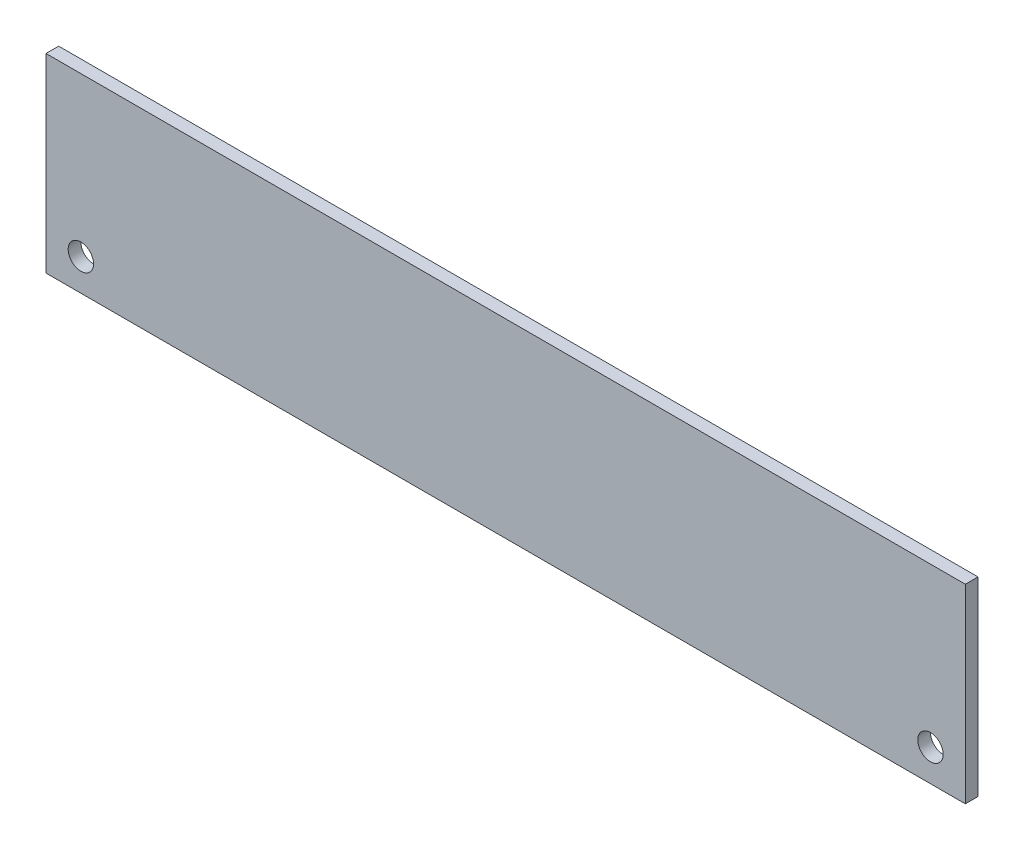
ISO-10303-21;
HEADER;
FILE_DESCRIPTION(('STEP AP214'),'2;1');
FILE_NAME('part.step','',(''),(''),'','','');
FILE_SCHEMA(('AUTOMOTIVE_DESIGN { 1 0 10303 214 1 1 1 1 }'));
ENDSEC;
DATA;
#1=APPLICATION_CONTEXT('core data for automotive mechanical design processes');
#2=APPLICATION_PROTOCOL_DEFINITION('international standard','automotive_design',2000,#1);
#3=PRODUCT_CONTEXT('',#1,'mechanical');
#4=PRODUCT('Part','Part','',(#3));
#5=PRODUCT_RELATED_PRODUCT_CATEGORY('part','',(#4));
#6=PRODUCT_DEFINITION_FORMATION('','',#4);
#7=PRODUCT_DEFINITION_CONTEXT('part definition',#1,'design');
#8=PRODUCT_DEFINITION('design','',#6,#7);
#9=PRODUCT_DEFINITION_SHAPE('','',#8);
#10=(LENGTH_UNIT() NAMED_UNIT(*) SI_UNIT(.MILLI.,.METRE.));
#11=(NAMED_UNIT(*) PLANE_ANGLE_UNIT() SI_UNIT($,.RADIAN.));
#12=(NAMED_UNIT(*) SI_UNIT($,.STERADIAN.) SOLID_ANGLE_UNIT());
#13=UNCERTAINTY_MEASURE_WITH_UNIT(LENGTH_MEASURE(1.E-05),#10,'distance_accuracy_value','');
#14=(GEOMETRIC_REPRESENTATION_CONTEXT(3) GLOBAL_UNCERTAINTY_ASSIGNED_CONTEXT((#13)) GLOBAL_UNIT_ASSIGNED_CONTEXT((#10,
#11,#12)) REPRESENTATION_CONTEXT('',''));
#15=CARTESIAN_POINT('',(0.,0.,0.));
#16=DIRECTION('',(0.,0.,1.));
#17=DIRECTION('',(1.,0.,0.));
#18=AXIS2_PLACEMENT_3D('',#15,#16,#17);
#19=CARTESIAN_POINT('',(0.,30.,2.));
#20=DIRECTION('',(0.,0.,1.));
#21=DIRECTION('',(1.,0.,0.));
#22=AXIS2_PLACEMENT_3D('',#19,#20,#21);
#23=PLANE('',#22);
#24=CARTESIAN_POINT('',(-5.49999999999999,5.00000000000001,2.));
#25=DIRECTION('',(0.,0.,1.));
#26=DIRECTION('',(1.,0.,0.));
#27=AXIS2_PLACEMENT_3D('',#24,#25,#26);
#28=CIRCLE('',#27,2.);
#29=CARTESIAN_POINT('',(-3.49999999999999,5.00000000000001,2.));
#30=VERTEX_POINT('',#29);
#31=EDGE_CURVE('E85',#30,#30,#28,.T.);
#32=ORIENTED_EDGE('',*,*,#31,.F.);
#33=EDGE_LOOP('',(#32));
#34=FACE_BOUND('',#33,.T.);
#35=DIRECTION('',(0.,1.,0.));
#36=VECTOR('',#35,1.);
#37=CARTESIAN_POINT('',(0.,0.,2.));
#38=LINE('',#37,#36);
#39=CARTESIAN_POINT('',(0.,0.,2.));
#40=VERTEX_POINT('',#39);
#41=CARTESIAN_POINT('',(0.,30.,2.));
#42=VERTEX_POINT('',#41);
#43=EDGE_CURVE('E95',#40,#42,#38,.T.);
#44=ORIENTED_EDGE('',*,*,#43,.T.);
#45=DIRECTION('',(-1.,0.,0.));
#46=VECTOR('',#45,1.);
#47=CARTESIAN_POINT('',(0.,30.,2.));
#48=LINE('',#47,#46);
#49=CARTESIAN_POINT('',(-145.,30.,2.));
#50=VERTEX_POINT('',#49);
#51=EDGE_CURVE('E80',#42,#50,#48,.T.);
#52=ORIENTED_EDGE('',*,*,#51,.T.);
#53=DIRECTION('',(0.,-1.,0.));
#54=VECTOR('',#53,1.);
#55=CARTESIAN_POINT('',(-145.,0.,2.));
#56=LINE('',#55,#54);
#57=CARTESIAN_POINT('',(-145.,0.,2.));
#58=VERTEX_POINT('',#57);
#59=EDGE_CURVE('E46',#50,#58,#56,.T.);
#60=ORIENTED_EDGE('',*,*,#59,.T.);
#61=DIRECTION('',(1.,0.,0.));
#62=VECTOR('',#61,1.);
#63=CARTESIAN_POINT('',(0.,0.,2.));
#64=LINE('',#63,#62);
#65=EDGE_CURVE('E41',#58,#40,#64,.T.);
#66=ORIENTED_EDGE('',*,*,#65,.T.);
#67=EDGE_LOOP('',(#44,#52,#60,#66));
#68=FACE_BOUND('',#67,.T.);
#69=CARTESIAN_POINT('',(-139.5,5.,2.));
#70=DIRECTION('',(0.,0.,1.));
#71=DIRECTION('',(1.,0.,0.));
#72=AXIS2_PLACEMENT_3D('',#69,#70,#71);
#73=CIRCLE('',#72,2.);
#74=CARTESIAN_POINT('',(-137.5,5.,2.));
#75=VERTEX_POINT('',#74);
#76=EDGE_CURVE('E113',#75,#75,#73,.T.);
#77=ORIENTED_EDGE('',*,*,#76,.F.);
#78=EDGE_LOOP('',(#77));
#79=FACE_BOUND('',#78,.T.);
#80=ADVANCED_FACE('F26',(#34,#68,#79),#23,.T.);
#81=CARTESIAN_POINT('',(0.,30.,0.));
#82=DIRECTION('',(0.,0.,1.));
#83=DIRECTION('',(1.,0.,0.));
#84=AXIS2_PLACEMENT_3D('',#81,#82,#83);
#85=PLANE('',#84);
#86=CARTESIAN_POINT('',(-5.49999999999999,5.00000000000001,0.));
#87=DIRECTION('',(0.,0.,1.));
#88=DIRECTION('',(1.,0.,0.));
#89=AXIS2_PLACEMENT_3D('',#86,#87,#88);
#90=CIRCLE('',#89,2.);
#91=CARTESIAN_POINT('',(-3.49999999999999,5.00000000000001,0.));
#92=VERTEX_POINT('',#91);
#93=EDGE_CURVE('E88',#92,#92,#90,.T.);
#94=ORIENTED_EDGE('',*,*,#93,.T.);
#95=EDGE_LOOP('',(#94));
#96=FACE_BOUND('',#95,.T.);
#97=DIRECTION('',(0.,1.,0.));
#98=VECTOR('',#97,1.);
#99=CARTESIAN_POINT('',(0.,0.,0.));
#100=LINE('',#99,#98);
#101=CARTESIAN_POINT('',(0.,0.,0.));
#102=VERTEX_POINT('',#101);
#103=CARTESIAN_POINT('',(0.,30.,0.));
#104=VERTEX_POINT('',#103);
#105=EDGE_CURVE('E72',#102,#104,#100,.T.);
#106=ORIENTED_EDGE('',*,*,#105,.F.);
#107=DIRECTION('',(1.,0.,0.));
#108=VECTOR('',#107,1.);
#109=CARTESIAN_POINT('',(0.,0.,0.));
#110=LINE('',#109,#108);
#111=CARTESIAN_POINT('',(-145.,0.,0.));
#112=VERTEX_POINT('',#111);
#113=EDGE_CURVE('E93',#112,#102,#110,.T.);
#114=ORIENTED_EDGE('',*,*,#113,.F.);
#115=DIRECTION('',(0.,-1.,0.));
#116=VECTOR('',#115,1.);
#117=CARTESIAN_POINT('',(-145.,0.,0.));
#118=LINE('',#117,#116);
#119=CARTESIAN_POINT('',(-145.,30.,0.));
#120=VERTEX_POINT('',#119);
#121=EDGE_CURVE('E73',#120,#112,#118,.T.);
#122=ORIENTED_EDGE('',*,*,#121,.F.);
#123=DIRECTION('',(-1.,0.,0.));
#124=VECTOR('',#123,1.);
#125=CARTESIAN_POINT('',(0.,30.,0.));
#126=LINE('',#125,#124);
#127=EDGE_CURVE('E67',#104,#120,#126,.T.);
#128=ORIENTED_EDGE('',*,*,#127,.F.);
#129=EDGE_LOOP('',(#106,#114,#122,#128));
#130=FACE_BOUND('',#129,.T.);
#131=CARTESIAN_POINT('',(-139.5,5.,0.));
#132=DIRECTION('',(0.,0.,1.));
#133=DIRECTION('',(1.,0.,0.));
#134=AXIS2_PLACEMENT_3D('',#131,#132,#133);
#135=CIRCLE('',#134,2.);
#136=CARTESIAN_POINT('',(-137.5,5.,0.));
#137=VERTEX_POINT('',#136);
#138=EDGE_CURVE('E115',#137,#137,#135,.T.);
#139=ORIENTED_EDGE('',*,*,#138,.T.);
#140=EDGE_LOOP('',(#139));
#141=FACE_BOUND('',#140,.T.);
#142=ADVANCED_FACE('F68',(#96,#130,#141),#85,.F.);
#143=CARTESIAN_POINT('',(0.,0.,2.));
#144=DIRECTION('',(-1.,0.,0.));
#145=DIRECTION('',(0.,0.,1.));
#146=AXIS2_PLACEMENT_3D('',#143,#144,#145);
#147=PLANE('',#146);
#148=ORIENTED_EDGE('',*,*,#105,.T.);
#149=DIRECTION('',(0.,0.,-1.));
#150=VECTOR('',#149,1.);
#151=CARTESIAN_POINT('',(0.,30.,2.));
#152=LINE('',#151,#150);
#153=EDGE_CURVE('E11',#42,#104,#152,.T.);
#154=ORIENTED_EDGE('',*,*,#153,.F.);
#155=ORIENTED_EDGE('',*,*,#43,.F.);
#156=DIRECTION('',(0.,0.,-1.));
#157=VECTOR('',#156,1.);
#158=CARTESIAN_POINT('',(0.,0.,2.));
#159=LINE('',#158,#157);
#160=EDGE_CURVE('E84',#40,#102,#159,.T.);
#161=ORIENTED_EDGE('',*,*,#160,.T.);
#162=EDGE_LOOP('',(#148,#154,#155,#161));
#163=FACE_BOUND('',#162,.T.);
#164=ADVANCED_FACE('F28',(#163),#147,.F.);
#165=CARTESIAN_POINT('',(0.,30.,2.));
#166=DIRECTION('',(0.,-1.,0.));
#167=DIRECTION('',(0.,0.,-1.));
#168=AXIS2_PLACEMENT_3D('',#165,#166,#167);
#169=PLANE('',#168);
#170=ORIENTED_EDGE('',*,*,#127,.T.);
#171=DIRECTION('',(0.,0.,-1.));
#172=VECTOR('',#171,1.);
#173=CARTESIAN_POINT('',(-145.,30.,2.));
#174=LINE('',#173,#172);
#175=EDGE_CURVE('E34',#50,#120,#174,.T.);
#176=ORIENTED_EDGE('',*,*,#175,.F.);
#177=ORIENTED_EDGE('',*,*,#51,.F.);
#178=ORIENTED_EDGE('',*,*,#153,.T.);
#179=EDGE_LOOP('',(#170,#176,#177,#178));
#180=FACE_BOUND('',#179,.T.);
#181=ADVANCED_FACE('F79',(#180),#169,.F.);
#182=CARTESIAN_POINT('',(-145.,0.,2.));
#183=DIRECTION('',(1.,0.,0.));
#184=DIRECTION('',(0.,0.,-1.));
#185=AXIS2_PLACEMENT_3D('',#182,#183,#184);
#186=PLANE('',#185);
#187=ORIENTED_EDGE('',*,*,#121,.T.);
#188=DIRECTION('',(0.,0.,-1.));
#189=VECTOR('',#188,1.);
#190=CARTESIAN_POINT('',(-145.,0.,2.));
#191=LINE('',#190,#189);
#192=EDGE_CURVE('E101',#58,#112,#191,.T.);
#193=ORIENTED_EDGE('',*,*,#192,.F.);
#194=ORIENTED_EDGE('',*,*,#59,.F.);
#195=ORIENTED_EDGE('',*,*,#175,.T.);
#196=EDGE_LOOP('',(#187,#193,#194,#195));
#197=FACE_BOUND('',#196,.T.);
#198=ADVANCED_FACE('F104',(#197),#186,.F.);
#199=CARTESIAN_POINT('',(0.,0.,2.));
#200=DIRECTION('',(0.,1.,0.));
#201=DIRECTION('',(0.,0.,1.));
#202=AXIS2_PLACEMENT_3D('',#199,#200,#201);
#203=PLANE('',#202);
#204=ORIENTED_EDGE('',*,*,#113,.T.);
#205=ORIENTED_EDGE('',*,*,#160,.F.);
#206=ORIENTED_EDGE('',*,*,#65,.F.);
#207=ORIENTED_EDGE('',*,*,#192,.T.);
#208=EDGE_LOOP('',(#204,#205,#206,#207));
#209=FACE_BOUND('',#208,.T.);
#210=ADVANCED_FACE('F106',(#209),#203,.F.);
#211=CARTESIAN_POINT('',(-5.49999999999999,5.00000000000001,2.));
#212=DIRECTION('',(0.,0.,-1.));
#213=DIRECTION('',(-1.,0.,0.));
#214=AXIS2_PLACEMENT_3D('',#211,#212,#213);
#215=CYLINDRICAL_SURFACE('',#214,2.);
#216=ORIENTED_EDGE('',*,*,#31,.T.);
#217=EDGE_LOOP('',(#216));
#218=FACE_BOUND('',#217,.T.);
#219=ORIENTED_EDGE('',*,*,#93,.F.);
#220=EDGE_LOOP('',(#219));
#221=FACE_BOUND('',#220,.T.);
#222=ADVANCED_FACE('F124',(#218,#221),#215,.F.);
#223=CARTESIAN_POINT('',(-139.5,5.,2.));
#224=DIRECTION('',(0.,0.,-1.));
#225=DIRECTION('',(-1.,0.,0.));
#226=AXIS2_PLACEMENT_3D('',#223,#224,#225);
#227=CYLINDRICAL_SURFACE('',#226,2.);
#228=ORIENTED_EDGE('',*,*,#76,.T.);
#229=EDGE_LOOP('',(#228));
#230=FACE_BOUND('',#229,.T.);
#231=ORIENTED_EDGE('',*,*,#138,.F.);
#232=EDGE_LOOP('',(#231));
#233=FACE_BOUND('',#232,.T.);
#234=ADVANCED_FACE('F122',(#230,#233),#227,.F.);
#235=CLOSED_SHELL('',(#80,#142,#164,#181,#198,#210,#222,#234));
#236=MANIFOLD_SOLID_BREP('B2',#235);
#237=ADVANCED_BREP_SHAPE_REPRESENTATION('',(#18,#236),#14);
#238=SHAPE_DEFINITION_REPRESENTATION(#9,#237);
ENDSEC;
END-ISO-10303-21;
